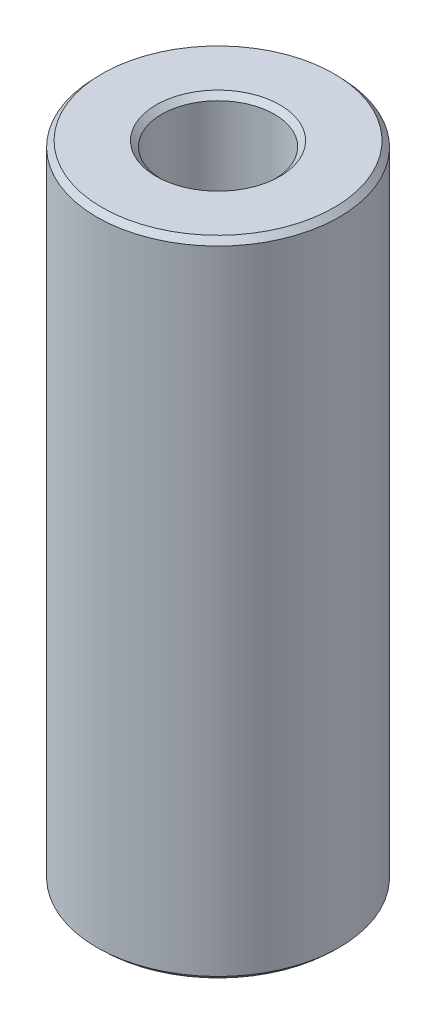
ISO-10303-21;
HEADER;
FILE_DESCRIPTION(('STEP AP214'),'2;1');
FILE_NAME('part.step','',(''),(''),'','','');
FILE_SCHEMA(('AUTOMOTIVE_DESIGN { 1 0 10303 214 1 1 1 1 }'));
ENDSEC;
DATA;
#1=APPLICATION_CONTEXT('core data for automotive mechanical design processes');
#2=APPLICATION_PROTOCOL_DEFINITION('international standard','automotive_design',2000,#1);
#3=PRODUCT_CONTEXT('',#1,'mechanical');
#4=PRODUCT('Part','Part','',(#3));
#5=PRODUCT_RELATED_PRODUCT_CATEGORY('part','',(#4));
#6=PRODUCT_DEFINITION_FORMATION('','',#4);
#7=PRODUCT_DEFINITION_CONTEXT('part definition',#1,'design');
#8=PRODUCT_DEFINITION('design','',#6,#7);
#9=PRODUCT_DEFINITION_SHAPE('','',#8);
#10=(LENGTH_UNIT() NAMED_UNIT(*) SI_UNIT(.MILLI.,.METRE.));
#11=(NAMED_UNIT(*) PLANE_ANGLE_UNIT() SI_UNIT($,.RADIAN.));
#12=(NAMED_UNIT(*) SI_UNIT($,.STERADIAN.) SOLID_ANGLE_UNIT());
#13=UNCERTAINTY_MEASURE_WITH_UNIT(LENGTH_MEASURE(1.E-05),#10,'distance_accuracy_value','');
#14=(GEOMETRIC_REPRESENTATION_CONTEXT(3) GLOBAL_UNCERTAINTY_ASSIGNED_CONTEXT((#13)) GLOBAL_UNIT_ASSIGNED_CONTEXT((#10,
#11,#12)) REPRESENTATION_CONTEXT('',''));
#15=CARTESIAN_POINT('',(0.,0.,0.));
#16=DIRECTION('',(0.,0.,1.));
#17=DIRECTION('',(1.,0.,0.));
#18=AXIS2_PLACEMENT_3D('',#15,#16,#17);
#19=CARTESIAN_POINT('',(0.,318.387145912432,0.));
#20=DIRECTION('',(0.,-1.,0.));
#21=DIRECTION('',(0.,0.,-1.));
#22=AXIS2_PLACEMENT_3D('',#19,#20,#21);
#23=CYLINDRICAL_SURFACE('',#22,60.);
#24=CARTESIAN_POINT('',(0.,2.61698263448973,0.));
#25=DIRECTION('',(0.,1.,0.));
#26=DIRECTION('',(0.,0.,1.));
#27=AXIS2_PLACEMENT_3D('',#24,#25,#26);
#28=CIRCLE('',#27,60.);
#29=CARTESIAN_POINT('',(0.,2.61698263448973,60.));
#30=VERTEX_POINT('',#29);
#31=EDGE_CURVE('E10',#30,#30,#28,.T.);
#32=ORIENTED_EDGE('',*,*,#31,.T.);
#33=EDGE_LOOP('',(#32));
#34=FACE_BOUND('',#33,.T.);
#35=CARTESIAN_POINT('',(0.,315.609626667554,0.));
#36=DIRECTION('',(0.,1.,0.));
#37=DIRECTION('',(0.,0.,1.));
#38=AXIS2_PLACEMENT_3D('',#35,#36,#37);
#39=CIRCLE('',#38,60.);
#40=CARTESIAN_POINT('',(0.,315.609626667554,60.));
#41=VERTEX_POINT('',#40);
#42=EDGE_CURVE('E50',#41,#41,#39,.F.);
#43=ORIENTED_EDGE('',*,*,#42,.T.);
#44=EDGE_LOOP('',(#43));
#45=FACE_BOUND('',#44,.T.);
#46=ADVANCED_FACE('F39',(#34,#45),#23,.T.);
#47=CARTESIAN_POINT('',(0.,318.387145912432,0.));
#48=DIRECTION('',(0.,1.,0.));
#49=DIRECTION('',(0.,0.,1.));
#50=AXIS2_PLACEMENT_3D('',#47,#48,#49);
#51=PLANE('',#50);
#52=CARTESIAN_POINT('',(0.,318.387145912432,0.));
#53=DIRECTION('',(0.,1.,0.));
#54=DIRECTION('',(0.,0.,1.));
#55=AXIS2_PLACEMENT_3D('',#52,#53,#54);
#56=CIRCLE('',#55,30.6571881830345);
#57=CARTESIAN_POINT('',(0.,318.387145912432,30.6571881830345));
#58=VERTEX_POINT('',#57);
#59=EDGE_CURVE('E58',#58,#58,#56,.F.);
#60=ORIENTED_EDGE('',*,*,#59,.T.);
#61=EDGE_LOOP('',(#60));
#62=FACE_BOUND('',#61,.T.);
#63=CARTESIAN_POINT('',(0.,318.387145912432,0.));
#64=DIRECTION('',(0.,1.,0.));
#65=DIRECTION('',(0.,0.,1.));
#66=AXIS2_PLACEMENT_3D('',#63,#64,#65);
#67=CIRCLE('',#66,57.3830173655102);
#68=CARTESIAN_POINT('',(0.,318.387145912432,57.3830173655102));
#69=VERTEX_POINT('',#68);
#70=EDGE_CURVE('E61',#69,#69,#67,.T.);
#71=ORIENTED_EDGE('',*,*,#70,.T.);
#72=EDGE_LOOP('',(#71));
#73=FACE_BOUND('',#72,.T.);
#74=ADVANCED_FACE('F88',(#62,#73),#51,.T.);
#75=CARTESIAN_POINT('',(0.,0.,0.));
#76=DIRECTION('',(0.,1.,0.));
#77=DIRECTION('',(0.,0.,1.));
#78=AXIS2_PLACEMENT_3D('',#75,#76,#77);
#79=PLANE('',#78);
#80=CARTESIAN_POINT('',(0.,0.,0.));
#81=DIRECTION('',(0.,1.,0.));
#82=DIRECTION('',(0.,0.,1.));
#83=AXIS2_PLACEMENT_3D('',#80,#81,#82);
#84=CIRCLE('',#83,30.496651572647);
#85=CARTESIAN_POINT('',(0.,0.,30.496651572647));
#86=VERTEX_POINT('',#85);
#87=EDGE_CURVE('E51',#86,#86,#84,.T.);
#88=ORIENTED_EDGE('',*,*,#87,.T.);
#89=EDGE_LOOP('',(#88));
#90=FACE_BOUND('',#89,.T.);
#91=CARTESIAN_POINT('',(0.,0.,0.));
#92=DIRECTION('',(0.,1.,0.));
#93=DIRECTION('',(0.,0.,1.));
#94=AXIS2_PLACEMENT_3D('',#91,#92,#93);
#95=CIRCLE('',#94,57.2224807551228);
#96=CARTESIAN_POINT('',(0.,0.,57.2224807551228));
#97=VERTEX_POINT('',#96);
#98=EDGE_CURVE('E54',#97,#97,#95,.F.);
#99=ORIENTED_EDGE('',*,*,#98,.T.);
#100=EDGE_LOOP('',(#99));
#101=FACE_BOUND('',#100,.T.);
#102=ADVANCED_FACE('F83',(#90,#101),#79,.F.);
#103=CARTESIAN_POINT('',(0.,318.387145912432,0.));
#104=DIRECTION('',(0.,-1.,0.));
#105=DIRECTION('',(0.,0.,-1.));
#106=AXIS2_PLACEMENT_3D('',#103,#104,#105);
#107=CYLINDRICAL_SURFACE('',#106,27.8796689381573);
#108=CARTESIAN_POINT('',(0.,315.770163277942,0.));
#109=DIRECTION('',(0.,1.,0.));
#110=DIRECTION('',(0.,0.,1.));
#111=AXIS2_PLACEMENT_3D('',#108,#109,#110);
#112=CIRCLE('',#111,27.8796689381573);
#113=CARTESIAN_POINT('',(0.,315.770163277942,27.8796689381573));
#114=VERTEX_POINT('',#113);
#115=EDGE_CURVE('E67',#114,#114,#112,.T.);
#116=ORIENTED_EDGE('',*,*,#115,.T.);
#117=EDGE_LOOP('',(#116));
#118=FACE_BOUND('',#117,.T.);
#119=CARTESIAN_POINT('',(0.,2.77751924487729,0.));
#120=DIRECTION('',(0.,1.,0.));
#121=DIRECTION('',(0.,0.,1.));
#122=AXIS2_PLACEMENT_3D('',#119,#120,#121);
#123=CIRCLE('',#122,27.8796689381573);
#124=CARTESIAN_POINT('',(0.,2.77751924487729,27.8796689381573));
#125=VERTEX_POINT('',#124);
#126=EDGE_CURVE('E69',#125,#125,#123,.F.);
#127=ORIENTED_EDGE('',*,*,#126,.T.);
#128=EDGE_LOOP('',(#127));
#129=FACE_BOUND('',#128,.T.);
#130=ADVANCED_FACE('F71',(#118,#129),#107,.F.);
#131=CARTESIAN_POINT('',(0.,315.770163277942,0.));
#132=DIRECTION('',(0.,1.,0.));
#133=DIRECTION('',(0.,0.,1.));
#134=AXIS2_PLACEMENT_3D('',#131,#132,#133);
#135=CONICAL_SURFACE('',#134,27.8796689381573,0.815148684924041);
#136=ORIENTED_EDGE('',*,*,#59,.F.);
#137=EDGE_LOOP('',(#136));
#138=FACE_BOUND('',#137,.T.);
#139=ORIENTED_EDGE('',*,*,#115,.F.);
#140=EDGE_LOOP('',(#139));
#141=FACE_BOUND('',#140,.T.);
#142=ADVANCED_FACE('F77',(#138,#141),#135,.F.);
#143=CARTESIAN_POINT('',(0.,0.,0.));
#144=DIRECTION('',(0.,-1.,0.));
#145=DIRECTION('',(0.,0.,-1.));
#146=AXIS2_PLACEMENT_3D('',#143,#144,#145);
#147=CONICAL_SURFACE('',#146,30.496651572647,0.755647641870841);
#148=ORIENTED_EDGE('',*,*,#126,.F.);
#149=EDGE_LOOP('',(#148));
#150=FACE_BOUND('',#149,.T.);
#151=ORIENTED_EDGE('',*,*,#87,.F.);
#152=EDGE_LOOP('',(#151));
#153=FACE_BOUND('',#152,.T.);
#154=ADVANCED_FACE('F73',(#150,#153),#147,.F.);
#155=CARTESIAN_POINT('',(0.,2.61698263448973,0.));
#156=DIRECTION('',(0.,1.,0.));
#157=DIRECTION('',(0.,0.,1.));
#158=AXIS2_PLACEMENT_3D('',#155,#156,#157);
#159=CONICAL_SURFACE('',#158,60.,0.815148684924055);
#160=ORIENTED_EDGE('',*,*,#98,.F.);
#161=EDGE_LOOP('',(#160));
#162=FACE_BOUND('',#161,.T.);
#163=ORIENTED_EDGE('',*,*,#31,.F.);
#164=EDGE_LOOP('',(#163));
#165=FACE_BOUND('',#164,.T.);
#166=ADVANCED_FACE('F76',(#162,#165),#159,.T.);
#167=CARTESIAN_POINT('',(0.,318.387145912432,0.));
#168=DIRECTION('',(0.,-1.,0.));
#169=DIRECTION('',(0.,0.,-1.));
#170=AXIS2_PLACEMENT_3D('',#167,#168,#169);
#171=CONICAL_SURFACE('',#170,57.3830173655102,0.755647641870854);
#172=ORIENTED_EDGE('',*,*,#42,.F.);
#173=EDGE_LOOP('',(#172));
#174=FACE_BOUND('',#173,.T.);
#175=ORIENTED_EDGE('',*,*,#70,.F.);
#176=EDGE_LOOP('',(#175));
#177=FACE_BOUND('',#176,.T.);
#178=ADVANCED_FACE('F45',(#174,#177),#171,.T.);
#179=CLOSED_SHELL('',(#46,#74,#102,#130,#142,#154,#166,#178));
#180=MANIFOLD_SOLID_BREP('B2',#179);
#181=ADVANCED_BREP_SHAPE_REPRESENTATION('',(#18,#180),#14);
#182=SHAPE_DEFINITION_REPRESENTATION(#9,#181);
ENDSEC;
END-ISO-10303-21;
